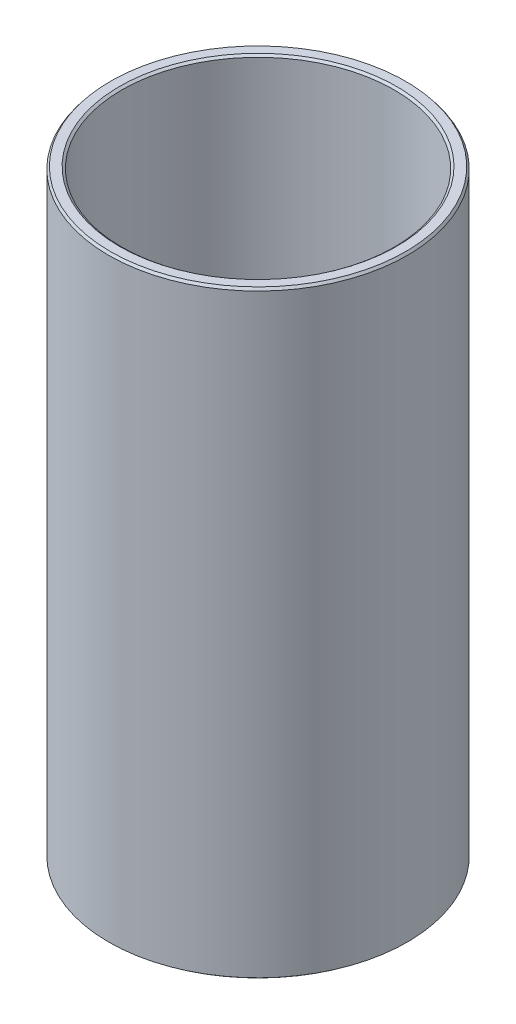
ISO-10303-21;
HEADER;
FILE_DESCRIPTION(('STEP AP214'),'2;1');
FILE_NAME('part.step','',(''),(''),'','','');
FILE_SCHEMA(('AUTOMOTIVE_DESIGN { 1 0 10303 214 1 1 1 1 }'));
ENDSEC;
DATA;
#1=APPLICATION_CONTEXT('core data for automotive mechanical design processes');
#2=APPLICATION_PROTOCOL_DEFINITION('international standard','automotive_design',2000,#1);
#3=PRODUCT_CONTEXT('',#1,'mechanical');
#4=PRODUCT('Part','Part','',(#3));
#5=PRODUCT_RELATED_PRODUCT_CATEGORY('part','',(#4));
#6=PRODUCT_DEFINITION_FORMATION('','',#4);
#7=PRODUCT_DEFINITION_CONTEXT('part definition',#1,'design');
#8=PRODUCT_DEFINITION('design','',#6,#7);
#9=PRODUCT_DEFINITION_SHAPE('','',#8);
#10=(LENGTH_UNIT() NAMED_UNIT(*) SI_UNIT(.MILLI.,.METRE.));
#11=(NAMED_UNIT(*) PLANE_ANGLE_UNIT() SI_UNIT($,.RADIAN.));
#12=(NAMED_UNIT(*) SI_UNIT($,.STERADIAN.) SOLID_ANGLE_UNIT());
#13=UNCERTAINTY_MEASURE_WITH_UNIT(LENGTH_MEASURE(1.E-05),#10,'distance_accuracy_value','');
#14=(GEOMETRIC_REPRESENTATION_CONTEXT(3) GLOBAL_UNCERTAINTY_ASSIGNED_CONTEXT((#13)) GLOBAL_UNIT_ASSIGNED_CONTEXT((#10,
#11,#12)) REPRESENTATION_CONTEXT('',''));
#15=CARTESIAN_POINT('',(0.,0.,0.));
#16=DIRECTION('',(0.,0.,1.));
#17=DIRECTION('',(1.,0.,0.));
#18=AXIS2_PLACEMENT_3D('',#15,#16,#17);
#19=CARTESIAN_POINT('',(0.,230.529604376123,0.));
#20=DIRECTION('',(0.,-1.,0.));
#21=DIRECTION('',(0.,0.,-1.));
#22=AXIS2_PLACEMENT_3D('',#19,#20,#21);
#23=CYLINDRICAL_SURFACE('',#22,57.5);
#24=CARTESIAN_POINT('',(0.,0.695042350240815,0.));
#25=DIRECTION('',(0.,1.,0.));
#26=DIRECTION('',(0.,0.,1.));
#27=AXIS2_PLACEMENT_3D('',#24,#25,#26);
#28=CIRCLE('',#27,57.5);
#29=CARTESIAN_POINT('',(0.,0.695042350240815,57.5));
#30=VERTEX_POINT('',#29);
#31=EDGE_CURVE('E10',#30,#30,#28,.T.);
#32=ORIENTED_EDGE('',*,*,#31,.T.);
#33=EDGE_LOOP('',(#32));
#34=FACE_BOUND('',#33,.T.);
#35=CARTESIAN_POINT('',(0.,229.629901148553,0.));
#36=DIRECTION('',(0.,1.,0.));
#37=DIRECTION('',(0.,0.,1.));
#38=AXIS2_PLACEMENT_3D('',#35,#36,#37);
#39=CIRCLE('',#38,57.5);
#40=CARTESIAN_POINT('',(0.,229.629901148553,57.5));
#41=VERTEX_POINT('',#40);
#42=EDGE_CURVE('E50',#41,#41,#39,.F.);
#43=ORIENTED_EDGE('',*,*,#42,.T.);
#44=EDGE_LOOP('',(#43));
#45=FACE_BOUND('',#44,.T.);
#46=ADVANCED_FACE('F39',(#34,#45),#23,.T.);
#47=CARTESIAN_POINT('',(0.,230.529604376123,0.));
#48=DIRECTION('',(0.,1.,0.));
#49=DIRECTION('',(0.,0.,1.));
#50=AXIS2_PLACEMENT_3D('',#47,#48,#49);
#51=PLANE('',#50);
#52=CARTESIAN_POINT('',(0.,230.529604376123,0.));
#53=DIRECTION('',(0.,1.,0.));
#54=DIRECTION('',(0.,0.,1.));
#55=AXIS2_PLACEMENT_3D('',#52,#53,#54);
#56=CIRCLE('',#55,53.3442520748709);
#57=CARTESIAN_POINT('',(0.,230.529604376123,53.3442520748709));
#58=VERTEX_POINT('',#57);
#59=EDGE_CURVE('E58',#58,#58,#56,.F.);
#60=ORIENTED_EDGE('',*,*,#59,.T.);
#61=EDGE_LOOP('',(#60));
#62=FACE_BOUND('',#61,.T.);
#63=CARTESIAN_POINT('',(0.,230.529604376123,0.));
#64=DIRECTION('',(0.,1.,0.));
#65=DIRECTION('',(0.,0.,1.));
#66=AXIS2_PLACEMENT_3D('',#63,#64,#65);
#67=CIRCLE('',#66,56.8049576497592);
#68=CARTESIAN_POINT('',(0.,230.529604376123,56.8049576497592));
#69=VERTEX_POINT('',#68);
#70=EDGE_CURVE('E61',#69,#69,#67,.T.);
#71=ORIENTED_EDGE('',*,*,#70,.T.);
#72=EDGE_LOOP('',(#71));
#73=FACE_BOUND('',#72,.T.);
#74=ADVANCED_FACE('F88',(#62,#73),#51,.T.);
#75=CARTESIAN_POINT('',(0.,0.,0.));
#76=DIRECTION('',(0.,1.,0.));
#77=DIRECTION('',(0.,0.,1.));
#78=AXIS2_PLACEMENT_3D('',#75,#76,#77);
#79=PLANE('',#78);
#80=CARTESIAN_POINT('',(0.,0.,0.));
#81=DIRECTION('',(0.,1.,0.));
#82=DIRECTION('',(0.,0.,1.));
#83=AXIS2_PLACEMENT_3D('',#80,#81,#82);
#84=CIRCLE('',#83,53.1395911975409);
#85=CARTESIAN_POINT('',(0.,0.,-53.1395911975409));
#86=VERTEX_POINT('',#85);
#87=EDGE_CURVE('E51',#86,#86,#84,.T.);
#88=ORIENTED_EDGE('',*,*,#87,.T.);
#89=EDGE_LOOP('',(#88));
#90=FACE_BOUND('',#89,.T.);
#91=CARTESIAN_POINT('',(0.,0.,0.));
#92=DIRECTION('',(0.,1.,0.));
#93=DIRECTION('',(0.,0.,1.));
#94=AXIS2_PLACEMENT_3D('',#91,#92,#93);
#95=CIRCLE('',#94,56.6002967724292);
#96=CARTESIAN_POINT('',(0.,0.,56.6002967724292));
#97=VERTEX_POINT('',#96);
#98=EDGE_CURVE('E54',#97,#97,#95,.F.);
#99=ORIENTED_EDGE('',*,*,#98,.T.);
#100=EDGE_LOOP('',(#99));
#101=FACE_BOUND('',#100,.T.);
#102=ADVANCED_FACE('F83',(#90,#101),#79,.F.);
#103=CARTESIAN_POINT('',(0.,230.529604376123,0.));
#104=DIRECTION('',(0.,-1.,0.));
#105=DIRECTION('',(0.,0.,-1.));
#106=AXIS2_PLACEMENT_3D('',#103,#104,#105);
#107=CYLINDRICAL_SURFACE('',#106,52.4445488473001);
#108=CARTESIAN_POINT('',(0.,229.834562025883,0.));
#109=DIRECTION('',(0.,1.,0.));
#110=DIRECTION('',(0.,0.,1.));
#111=AXIS2_PLACEMENT_3D('',#108,#109,#110);
#112=CIRCLE('',#111,52.4445488473001);
#113=CARTESIAN_POINT('',(0.,229.834562025883,52.4445488473001));
#114=VERTEX_POINT('',#113);
#115=EDGE_CURVE('E67',#114,#114,#112,.T.);
#116=ORIENTED_EDGE('',*,*,#115,.T.);
#117=EDGE_LOOP('',(#116));
#118=FACE_BOUND('',#117,.T.);
#119=CARTESIAN_POINT('',(0.,0.899703227570825,0.));
#120=DIRECTION('',(0.,1.,0.));
#121=DIRECTION('',(0.,0.,1.));
#122=AXIS2_PLACEMENT_3D('',#119,#120,#121);
#123=CIRCLE('',#122,52.4445488473001);
#124=CARTESIAN_POINT('',(0.,0.899703227570825,-52.4445488473001));
#125=VERTEX_POINT('',#124);
#126=EDGE_CURVE('E69',#125,#125,#123,.F.);
#127=ORIENTED_EDGE('',*,*,#126,.T.);
#128=EDGE_LOOP('',(#127));
#129=FACE_BOUND('',#128,.T.);
#130=ADVANCED_FACE('F71',(#118,#129),#107,.F.);
#131=CARTESIAN_POINT('',(0.,229.834562025883,0.));
#132=DIRECTION('',(0.,1.,0.));
#133=DIRECTION('',(0.,0.,1.));
#134=AXIS2_PLACEMENT_3D('',#131,#132,#133);
#135=CONICAL_SURFACE('',#134,52.4445488473001,0.913034999890379);
#136=ORIENTED_EDGE('',*,*,#59,.F.);
#137=EDGE_LOOP('',(#136));
#138=FACE_BOUND('',#137,.T.);
#139=ORIENTED_EDGE('',*,*,#115,.F.);
#140=EDGE_LOOP('',(#139));
#141=FACE_BOUND('',#140,.T.);
#142=ADVANCED_FACE('F77',(#138,#141),#135,.F.);
#143=CARTESIAN_POINT('',(0.,0.,0.));
#144=DIRECTION('',(0.,-1.,0.));
#145=DIRECTION('',(0.,0.,-1.));
#146=AXIS2_PLACEMENT_3D('',#143,#144,#145);
#147=CONICAL_SURFACE('',#146,53.1395911975409,0.657761326904529);
#148=CARTESIAN_POINT('',(0.,0.899703227570825,-52.4445488473001));
#149=CARTESIAN_POINT('',(0.,0.890331318950296,-52.4517888717818));
#150=CARTESIAN_POINT('',(0.,0.880959410329766,-52.4590288962634));
#151=CARTESIAN_POINT('',(0.,0.862215593088707,-52.4735089452268));
#152=CARTESIAN_POINT('',(0.,0.852843684468177,-52.4807489697085));
#153=CARTESIAN_POINT('',(0.,0.834099867227118,-52.4952290186718));
#154=CARTESIAN_POINT('',(0.,0.82472795860659,-52.5024690431535));
#155=CARTESIAN_POINT('',(0.,0.805984141365531,-52.5169490921168));
#156=CARTESIAN_POINT('',(0.,0.796612232745002,-52.5241891165985));
#157=CARTESIAN_POINT('',(0.,0.777868415503942,-52.5386691655619));
#158=CARTESIAN_POINT('',(0.,0.768496506883412,-52.5459091900436));
#159=CARTESIAN_POINT('',(0.,0.749752689642354,-52.5603892390069));
#160=CARTESIAN_POINT('',(0.,0.740380781021825,-52.5676292634886));
#161=CARTESIAN_POINT('',(0.,0.721636963780766,-52.5821093124519));
#162=CARTESIAN_POINT('',(0.,0.712265055160237,-52.5893493369336));
#163=CARTESIAN_POINT('',(0.,0.693521237919177,-52.603829385897));
#164=CARTESIAN_POINT('',(0.,0.684149329298648,-52.6110694103786));
#165=CARTESIAN_POINT('',(0.,0.665405512057589,-52.625549459342));
#166=CARTESIAN_POINT('',(0.,0.65603360343706,-52.6327894838237));
#167=CARTESIAN_POINT('',(0.,0.637289786196001,-52.647269532787));
#168=CARTESIAN_POINT('',(0.,0.627917877575471,-52.6545095572687));
#169=CARTESIAN_POINT('',(0.,0.609174060334412,-52.668989606232));
#170=CARTESIAN_POINT('',(0.,0.599802151713884,-52.6762296307137));
#171=CARTESIAN_POINT('',(0.,0.581058334472825,-52.6907096796771));
#172=CARTESIAN_POINT('',(0.,0.571686425852295,-52.6979497041587));
#173=CARTESIAN_POINT('',(0.,0.552942608611236,-52.7124297531221));
#174=CARTESIAN_POINT('',(0.,0.543570699990707,-52.7196697776038));
#175=CARTESIAN_POINT('',(0.,0.524826882749648,-52.7341498265671));
#176=CARTESIAN_POINT('',(0.,0.515454974129118,-52.7413898510488));
#177=CARTESIAN_POINT('',(0.,0.496711156888059,-52.7558699000121));
#178=CARTESIAN_POINT('',(0.,0.487339248267531,-52.7631099244938));
#179=CARTESIAN_POINT('',(0.,0.468595431026472,-52.7775899734572));
#180=CARTESIAN_POINT('',(0.,0.459223522405942,-52.7848299979388));
#181=CARTESIAN_POINT('',(0.,0.440479705164883,-52.7993100469022));
#182=CARTESIAN_POINT('',(0.,0.431107796544354,-52.8065500713839));
#183=CARTESIAN_POINT('',(0.,0.412363979303295,-52.8210301203472));
#184=CARTESIAN_POINT('',(0.,0.402992070682765,-52.8282701448289));
#185=CARTESIAN_POINT('',(0.,0.384248253441706,-52.8427501937922));
#186=CARTESIAN_POINT('',(0.,0.374876344821177,-52.8499902182739));
#187=CARTESIAN_POINT('',(0.,0.356132527580119,-52.8644702672373));
#188=CARTESIAN_POINT('',(0.,0.346760618959589,-52.8717102917189));
#189=CARTESIAN_POINT('',(0.,0.32801680171853,-52.8861903406823));
#190=CARTESIAN_POINT('',(0.,0.318644893098001,-52.893430365164));
#191=CARTESIAN_POINT('',(0.,0.299901075856941,-52.9079104141273));
#192=CARTESIAN_POINT('',(0.,0.290529167236411,-52.915150438609));
#193=CARTESIAN_POINT('',(0.,0.271785349995353,-52.9296304875723));
#194=CARTESIAN_POINT('',(0.,0.262413441374824,-52.936870512054));
#195=CARTESIAN_POINT('',(0.,0.243669624133766,-52.9513505610174));
#196=CARTESIAN_POINT('',(0.,0.234297715513236,-52.958590585499));
#197=CARTESIAN_POINT('',(0.,0.215553898272177,-52.9730706344624));
#198=CARTESIAN_POINT('',(0.,0.206181989651647,-52.9803106589441));
#199=CARTESIAN_POINT('',(0.,0.187438172410588,-52.9947907079074));
#200=CARTESIAN_POINT('',(0.,0.178066263790058,-53.0020307323891));
#201=CARTESIAN_POINT('',(0.,0.159322446549,-53.0165107813524));
#202=CARTESIAN_POINT('',(0.,0.149950537928471,-53.0237508058341));
#203=CARTESIAN_POINT('',(0.,0.131206720687413,-53.0382308547975));
#204=CARTESIAN_POINT('',(0.,0.121834812066883,-53.0454708792791));
#205=CARTESIAN_POINT('',(0.,0.103090994825823,-53.0599509282425));
#206=CARTESIAN_POINT('',(0.,0.0937190862052935,-53.0671909527242));
#207=CARTESIAN_POINT('',(0.,0.074975268964235,-53.0816710016875));
#208=CARTESIAN_POINT('',(0.,0.0656033603437064,-53.0889110261692));
#209=CARTESIAN_POINT('',(0.,0.0468595431026479,-53.1033910751325));
#210=CARTESIAN_POINT('',(0.,0.0374876344821181,-53.1106310996142));
#211=CARTESIAN_POINT('',(0.,0.0187438172410585,-53.1251111485776));
#212=CARTESIAN_POINT('',(0.,0.00937190862052868,-53.1323511730592));
#213=CARTESIAN_POINT('',(0.,0.,-53.1395911975409));
#214=B_SPLINE_CURVE_WITH_KNOTS('',3,(#148,#149,#150,#151,#152,#153,#154,#155,#156,#157,#158,
#159,#160,#161,#162,#163,#164,#165,#166,#167,#168,#169,#170,#171,#172,#173,#174,#175,#176,#177,
#178,#179,#180,#181,#182,#183,#184,#185,#186,#187,#188,#189,#190,#191,#192,#193,#194,#195,#196,
#197,#198,#199,#200,#201,#202,#203,#204,#205,#206,#207,#208,#209,#210,#211,#212,#213),
.UNSPECIFIED.,.F.,.F.,(4,2,2,2,2,2,2,2,2,2,2,2,2,2,2,2,2,2,2,2,2,2,2,2,2,2,2,2,2,2,2,2,4),(0.,
0.035528237096445,0.07105647419289,0.106584711289339,0.142112948385784,0.177641185482229,
0.213169422578678,0.248697659675123,0.284225896771568,0.319754133868013,0.355282370964458,
0.390810608060908,0.426338845157352,0.461867082253797,0.497395319350242,0.532923556446692,
0.568451793543137,0.603980030639581,0.639508267736027,0.675036504832476,0.710564741928921,
0.746092979025366,0.781621216121811,0.81714945321826,0.852677690314705,0.88820592741115,
0.923734164507595,0.959262401604044,0.994790638700489,1.03031887579693,1.06584711289338,
1.10137534998983,1.13690358708627),.UNSPECIFIED.);
#215=EDGE_CURVE('BSEAM73',#125,#86,#214,.T.);
#216=ORIENTED_EDGE('',*,*,#126,.F.);
#217=ORIENTED_EDGE('',*,*,#87,.F.);
#218=ORIENTED_EDGE('',*,*,#215,.T.);
#219=ORIENTED_EDGE('',*,*,#215,.F.);
#220=EDGE_LOOP('',(#216,#218,#217,#219));
#221=FACE_BOUND('',#220,.T.);
#222=ADVANCED_FACE('F73',(#221),#147,.F.);
#223=CARTESIAN_POINT('',(0.,0.695042350240815,0.));
#224=DIRECTION('',(0.,1.,0.));
#225=DIRECTION('',(0.,0.,1.));
#226=AXIS2_PLACEMENT_3D('',#223,#224,#225);
#227=CONICAL_SURFACE('',#226,57.5,0.91303499989036);
#228=ORIENTED_EDGE('',*,*,#98,.F.);
#229=EDGE_LOOP('',(#228));
#230=FACE_BOUND('',#229,.T.);
#231=ORIENTED_EDGE('',*,*,#31,.F.);
#232=EDGE_LOOP('',(#231));
#233=FACE_BOUND('',#232,.T.);
#234=ADVANCED_FACE('F76',(#230,#233),#227,.T.);
#235=CARTESIAN_POINT('',(0.,230.529604376123,0.));
#236=DIRECTION('',(0.,-1.,0.));
#237=DIRECTION('',(0.,0.,-1.));
#238=AXIS2_PLACEMENT_3D('',#235,#236,#237);
#239=CONICAL_SURFACE('',#238,56.8049576497592,0.657761326904525);
#240=ORIENTED_EDGE('',*,*,#42,.F.);
#241=EDGE_LOOP('',(#240));
#242=FACE_BOUND('',#241,.T.);
#243=ORIENTED_EDGE('',*,*,#70,.F.);
#244=EDGE_LOOP('',(#243));
#245=FACE_BOUND('',#244,.T.);
#246=ADVANCED_FACE('F45',(#242,#245),#239,.T.);
#247=CLOSED_SHELL('',(#46,#74,#102,#130,#142,#222,#234,#246));
#248=MANIFOLD_SOLID_BREP('B2',#247);
#249=ADVANCED_BREP_SHAPE_REPRESENTATION('',(#18,#248),#14);
#250=SHAPE_DEFINITION_REPRESENTATION(#9,#249);
ENDSEC;
END-ISO-10303-21;
